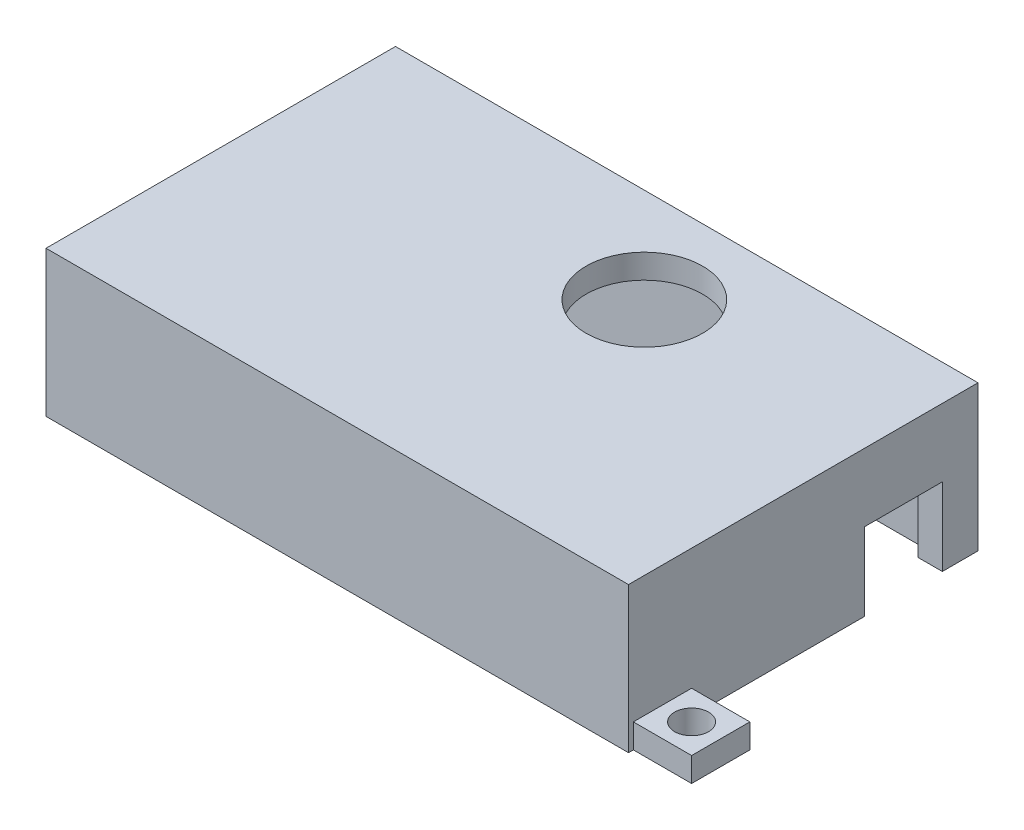
ISO-10303-21;
HEADER;
FILE_DESCRIPTION(('STEP AP214'),'2;1');
FILE_NAME('part.step','',(''),(''),'','','');
FILE_SCHEMA(('AUTOMOTIVE_DESIGN { 1 0 10303 214 1 1 1 1 }'));
ENDSEC;
DATA;
#1=APPLICATION_CONTEXT('core data for automotive mechanical design processes');
#2=APPLICATION_PROTOCOL_DEFINITION('international standard','automotive_design',2000,#1);
#3=PRODUCT_CONTEXT('',#1,'mechanical');
#4=PRODUCT('Part','Part','',(#3));
#5=PRODUCT_RELATED_PRODUCT_CATEGORY('part','',(#4));
#6=PRODUCT_DEFINITION_FORMATION('','',#4);
#7=PRODUCT_DEFINITION_CONTEXT('part definition',#1,'design');
#8=PRODUCT_DEFINITION('design','',#6,#7);
#9=PRODUCT_DEFINITION_SHAPE('','',#8);
#10=(LENGTH_UNIT() NAMED_UNIT(*) SI_UNIT(.MILLI.,.METRE.));
#11=(NAMED_UNIT(*) PLANE_ANGLE_UNIT() SI_UNIT($,.RADIAN.));
#12=(NAMED_UNIT(*) SI_UNIT($,.STERADIAN.) SOLID_ANGLE_UNIT());
#13=UNCERTAINTY_MEASURE_WITH_UNIT(LENGTH_MEASURE(1.E-05),#10,'distance_accuracy_value','');
#14=(GEOMETRIC_REPRESENTATION_CONTEXT(3) GLOBAL_UNCERTAINTY_ASSIGNED_CONTEXT((#13)) GLOBAL_UNIT_ASSIGNED_CONTEXT((#10,
#11,#12)) REPRESENTATION_CONTEXT('',''));
#15=CARTESIAN_POINT('',(0.,0.,0.));
#16=DIRECTION('',(0.,0.,1.));
#17=DIRECTION('',(1.,0.,0.));
#18=AXIS2_PLACEMENT_3D('',#15,#16,#17);
#19=CARTESIAN_POINT('',(30.,15.,-18.));
#20=DIRECTION('',(-1.,0.,0.));
#21=DIRECTION('',(0.,0.,1.));
#22=AXIS2_PLACEMENT_3D('',#19,#20,#21);
#23=PLANE('',#22);
#24=DIRECTION('',(0.,0.,1.));
#25=VECTOR('',#24,1.);
#26=CARTESIAN_POINT('',(30.,8.,-14.3270950221385));
#27=LINE('',#26,#25);
#28=CARTESIAN_POINT('',(30.,8.,-14.3270950221385));
#29=VERTEX_POINT('',#28);
#30=CARTESIAN_POINT('',(30.,8.,-6.32709502213846));
#31=VERTEX_POINT('',#30);
#32=EDGE_CURVE('E242',#29,#31,#27,.T.);
#33=ORIENTED_EDGE('',*,*,#32,.F.);
#34=DIRECTION('',(0.,1.,0.));
#35=VECTOR('',#34,1.);
#36=CARTESIAN_POINT('',(30.,0.,-14.3270950221385));
#37=LINE('',#36,#35);
#38=CARTESIAN_POINT('',(30.,0.,-14.3270950221385));
#39=VERTEX_POINT('',#38);
#40=EDGE_CURVE('E252',#39,#29,#37,.T.);
#41=ORIENTED_EDGE('',*,*,#40,.F.);
#42=DIRECTION('',(0.,0.,-1.));
#43=VECTOR('',#42,1.);
#44=CARTESIAN_POINT('',(30.,0.,-18.));
#45=LINE('',#44,#43);
#46=CARTESIAN_POINT('',(30.,0.,-18.));
#47=VERTEX_POINT('',#46);
#48=EDGE_CURVE('E497',#39,#47,#45,.T.);
#49=ORIENTED_EDGE('',*,*,#48,.T.);
#50=DIRECTION('',(0.,-1.,0.));
#51=VECTOR('',#50,1.);
#52=CARTESIAN_POINT('',(30.,15.,-18.));
#53=LINE('',#52,#51);
#54=CARTESIAN_POINT('',(30.,15.,-18.));
#55=VERTEX_POINT('',#54);
#56=EDGE_CURVE('E508',#55,#47,#53,.T.);
#57=ORIENTED_EDGE('',*,*,#56,.F.);
#58=DIRECTION('',(0.,0.,-1.));
#59=VECTOR('',#58,1.);
#60=CARTESIAN_POINT('',(30.,15.,-18.));
#61=LINE('',#60,#59);
#62=CARTESIAN_POINT('',(30.,15.,18.));
#63=VERTEX_POINT('',#62);
#64=EDGE_CURVE('E485',#63,#55,#61,.T.);
#65=ORIENTED_EDGE('',*,*,#64,.F.);
#66=DIRECTION('',(0.,-1.,0.));
#67=VECTOR('',#66,1.);
#68=CARTESIAN_POINT('',(30.,15.,18.));
#69=LINE('',#68,#67);
#70=CARTESIAN_POINT('',(30.,0.,18.));
#71=VERTEX_POINT('',#70);
#72=EDGE_CURVE('E512',#63,#71,#69,.T.);
#73=ORIENTED_EDGE('',*,*,#72,.T.);
#74=CARTESIAN_POINT('',(30.,0.,17.5));
#75=VERTEX_POINT('',#74);
#76=EDGE_CURVE('E498',#71,#75,#45,.T.);
#77=ORIENTED_EDGE('',*,*,#76,.T.);
#78=DIRECTION('',(0.,-1.,0.));
#79=VECTOR('',#78,1.);
#80=CARTESIAN_POINT('',(30.,2.5,17.5));
#81=LINE('',#80,#79);
#82=CARTESIAN_POINT('',(30.,2.5,17.5));
#83=VERTEX_POINT('',#82);
#84=EDGE_CURVE('E418',#83,#75,#81,.T.);
#85=ORIENTED_EDGE('',*,*,#84,.F.);
#86=DIRECTION('',(0.,0.,-1.));
#87=VECTOR('',#86,1.);
#88=CARTESIAN_POINT('',(30.,2.5,17.5));
#89=LINE('',#88,#87);
#90=CARTESIAN_POINT('',(30.,2.5,11.5));
#91=VERTEX_POINT('',#90);
#92=EDGE_CURVE('E393',#83,#91,#89,.T.);
#93=ORIENTED_EDGE('',*,*,#92,.T.);
#94=DIRECTION('',(0.,-1.,0.));
#95=VECTOR('',#94,1.);
#96=CARTESIAN_POINT('',(30.,2.5,11.5));
#97=LINE('',#96,#95);
#98=CARTESIAN_POINT('',(30.,0.,11.5));
#99=VERTEX_POINT('',#98);
#100=EDGE_CURVE('E408',#91,#99,#97,.T.);
#101=ORIENTED_EDGE('',*,*,#100,.T.);
#102=CARTESIAN_POINT('',(30.,0.,-6.32709502213846));
#103=VERTEX_POINT('',#102);
#104=EDGE_CURVE('E502',#99,#103,#45,.T.);
#105=ORIENTED_EDGE('',*,*,#104,.T.);
#106=DIRECTION('',(0.,-1.,0.));
#107=VECTOR('',#106,1.);
#108=CARTESIAN_POINT('',(30.,8.,-6.32709502213846));
#109=LINE('',#108,#107);
#110=EDGE_CURVE('E249',#31,#103,#109,.T.);
#111=ORIENTED_EDGE('',*,*,#110,.F.);
#112=EDGE_LOOP('',(#33,#41,#49,#57,#65,#73,#77,#85,#93,#101,#105,#111));
#113=FACE_BOUND('',#112,.T.);
#114=ADVANCED_FACE('F73',(#113),#23,.F.);
#115=CARTESIAN_POINT('',(0.,0.,0.));
#116=DIRECTION('',(0.,-1.,0.));
#117=DIRECTION('',(0.,0.,-1.));
#118=AXIS2_PLACEMENT_3D('',#115,#116,#117);
#119=PLANE('',#118);
#120=DIRECTION('',(1.,0.,0.));
#121=VECTOR('',#120,1.);
#122=CARTESIAN_POINT('',(17.5,0.,-14.3270950221385));
#123=LINE('',#122,#121);
#124=CARTESIAN_POINT('',(27.5,0.,-14.3270950221385));
#125=VERTEX_POINT('',#124);
#126=EDGE_CURVE('E255',#125,#39,#123,.T.);
#127=ORIENTED_EDGE('',*,*,#126,.F.);
#128=DIRECTION('',(0.,0.,-1.));
#129=VECTOR('',#128,1.);
#130=CARTESIAN_POINT('',(27.5,0.,15.5));
#131=LINE('',#130,#129);
#132=CARTESIAN_POINT('',(27.5,0.,-15.5));
#133=VERTEX_POINT('',#132);
#134=EDGE_CURVE('E454',#125,#133,#131,.T.);
#135=ORIENTED_EDGE('',*,*,#134,.T.);
#136=DIRECTION('',(-1.,0.,0.));
#137=VECTOR('',#136,1.);
#138=CARTESIAN_POINT('',(27.5,0.,-15.5));
#139=LINE('',#138,#137);
#140=CARTESIAN_POINT('',(-27.5,0.,-15.5));
#141=VERTEX_POINT('',#140);
#142=EDGE_CURVE('E437',#133,#141,#139,.T.);
#143=ORIENTED_EDGE('',*,*,#142,.T.);
#144=DIRECTION('',(0.,0.,1.));
#145=VECTOR('',#144,1.);
#146=CARTESIAN_POINT('',(-27.5,0.,15.5));
#147=LINE('',#146,#145);
#148=CARTESIAN_POINT('',(-27.5,0.,15.5));
#149=VERTEX_POINT('',#148);
#150=EDGE_CURVE('E421',#141,#149,#147,.T.);
#151=ORIENTED_EDGE('',*,*,#150,.T.);
#152=DIRECTION('',(1.,0.,0.));
#153=VECTOR('',#152,1.);
#154=CARTESIAN_POINT('',(27.5,0.,15.5));
#155=LINE('',#154,#153);
#156=CARTESIAN_POINT('',(27.5,0.,15.5));
#157=VERTEX_POINT('',#156);
#158=EDGE_CURVE('E450',#149,#157,#155,.T.);
#159=ORIENTED_EDGE('',*,*,#158,.T.);
#160=CARTESIAN_POINT('',(27.5,0.,-6.32709502213846));
#161=VERTEX_POINT('',#160);
#162=EDGE_CURVE('E455',#157,#161,#131,.T.);
#163=ORIENTED_EDGE('',*,*,#162,.T.);
#164=DIRECTION('',(1.,0.,0.));
#165=VECTOR('',#164,1.);
#166=CARTESIAN_POINT('',(17.5,0.,-6.32709502213846));
#167=LINE('',#166,#165);
#168=EDGE_CURVE('E269',#161,#103,#167,.T.);
#169=ORIENTED_EDGE('',*,*,#168,.T.);
#170=ORIENTED_EDGE('',*,*,#104,.F.);
#171=DIRECTION('',(1.,0.,0.));
#172=VECTOR('',#171,1.);
#173=CARTESIAN_POINT('',(30.,0.,11.5));
#174=LINE('',#173,#172);
#175=CARTESIAN_POINT('',(36.,0.,11.5));
#176=VERTEX_POINT('',#175);
#177=EDGE_CURVE('E389',#99,#176,#174,.T.);
#178=ORIENTED_EDGE('',*,*,#177,.T.);
#179=DIRECTION('',(0.,0.,-1.));
#180=VECTOR('',#179,1.);
#181=CARTESIAN_POINT('',(36.,0.,17.5));
#182=LINE('',#181,#180);
#183=CARTESIAN_POINT('',(36.,0.,17.5));
#184=VERTEX_POINT('',#183);
#185=EDGE_CURVE('E412',#184,#176,#182,.T.);
#186=ORIENTED_EDGE('',*,*,#185,.F.);
#187=DIRECTION('',(1.,0.,0.));
#188=VECTOR('',#187,1.);
#189=CARTESIAN_POINT('',(30.,0.,17.5));
#190=LINE('',#189,#188);
#191=EDGE_CURVE('E398',#75,#184,#190,.T.);
#192=ORIENTED_EDGE('',*,*,#191,.F.);
#193=ORIENTED_EDGE('',*,*,#76,.F.);
#194=DIRECTION('',(1.,0.,0.));
#195=VECTOR('',#194,1.);
#196=CARTESIAN_POINT('',(30.,0.,18.));
#197=LINE('',#196,#195);
#198=CARTESIAN_POINT('',(-30.,0.,18.));
#199=VERTEX_POINT('',#198);
#200=EDGE_CURVE('E494',#199,#71,#197,.T.);
#201=ORIENTED_EDGE('',*,*,#200,.F.);
#202=DIRECTION('',(0.,0.,1.));
#203=VECTOR('',#202,1.);
#204=CARTESIAN_POINT('',(-30.,0.,-18.));
#205=LINE('',#204,#203);
#206=CARTESIAN_POINT('',(-30.,0.,-12.));
#207=VERTEX_POINT('',#206);
#208=EDGE_CURVE('E476',#207,#199,#205,.T.);
#209=ORIENTED_EDGE('',*,*,#208,.F.);
#210=DIRECTION('',(-1.,0.,0.));
#211=VECTOR('',#210,1.);
#212=CARTESIAN_POINT('',(-30.,0.,-12.));
#213=LINE('',#212,#211);
#214=CARTESIAN_POINT('',(-36.,0.,-12.));
#215=VERTEX_POINT('',#214);
#216=EDGE_CURVE('E359',#207,#215,#213,.T.);
#217=ORIENTED_EDGE('',*,*,#216,.T.);
#218=DIRECTION('',(0.,0.,1.));
#219=VECTOR('',#218,1.);
#220=CARTESIAN_POINT('',(-36.,0.,-18.));
#221=LINE('',#220,#219);
#222=CARTESIAN_POINT('',(-36.,0.,-18.));
#223=VERTEX_POINT('',#222);
#224=EDGE_CURVE('E355',#223,#215,#221,.T.);
#225=ORIENTED_EDGE('',*,*,#224,.F.);
#226=DIRECTION('',(-1.,0.,0.));
#227=VECTOR('',#226,1.);
#228=CARTESIAN_POINT('',(30.,0.,-18.));
#229=LINE('',#228,#227);
#230=EDGE_CURVE('E482',#47,#223,#229,.T.);
#231=ORIENTED_EDGE('',*,*,#230,.F.);
#232=ORIENTED_EDGE('',*,*,#48,.F.);
#233=EDGE_LOOP('',(#127,#135,#143,#151,#159,#163,#169,#170,#178,#186,#192,#193,#201,#209,#217,
#225,#231,#232));
#234=FACE_BOUND('',#233,.T.);
#235=CARTESIAN_POINT('',(33.,0.,14.5));
#236=DIRECTION('',(0.,1.,0.));
#237=DIRECTION('',(0.,0.,1.));
#238=AXIS2_PLACEMENT_3D('',#235,#236,#237);
#239=CIRCLE('',#238,1.75);
#240=CARTESIAN_POINT('',(33.,0.,16.25));
#241=VERTEX_POINT('',#240);
#242=EDGE_CURVE('E381',#241,#241,#239,.T.);
#243=ORIENTED_EDGE('',*,*,#242,.T.);
#244=EDGE_LOOP('',(#243));
#245=FACE_BOUND('',#244,.T.);
#246=CARTESIAN_POINT('',(-33.,0.,-15.));
#247=DIRECTION('',(0.,1.,0.));
#248=DIRECTION('',(0.,0.,1.));
#249=AXIS2_PLACEMENT_3D('',#246,#247,#248);
#250=CIRCLE('',#249,1.75);
#251=CARTESIAN_POINT('',(-33.,0.,-13.25));
#252=VERTEX_POINT('',#251);
#253=EDGE_CURVE('E377',#252,#252,#250,.T.);
#254=ORIENTED_EDGE('',*,*,#253,.T.);
#255=EDGE_LOOP('',(#254));
#256=FACE_BOUND('',#255,.T.);
#257=ADVANCED_FACE('F533',(#234,#245,#256),#119,.T.);
#258=CARTESIAN_POINT('',(-30.,15.,-18.));
#259=DIRECTION('',(1.,0.,0.));
#260=DIRECTION('',(0.,0.,-1.));
#261=AXIS2_PLACEMENT_3D('',#258,#259,#260);
#262=PLANE('',#261);
#263=DIRECTION('',(0.,-1.,0.));
#264=VECTOR('',#263,1.);
#265=CARTESIAN_POINT('',(-30.,15.,-18.));
#266=LINE('',#265,#264);
#267=CARTESIAN_POINT('',(-30.,15.,-18.));
#268=VERTEX_POINT('',#267);
#269=CARTESIAN_POINT('',(-30.,2.5,-18.));
#270=VERTEX_POINT('',#269);
#271=EDGE_CURVE('E491',#268,#270,#266,.T.);
#272=ORIENTED_EDGE('',*,*,#271,.T.);
#273=DIRECTION('',(0.,0.,1.));
#274=VECTOR('',#273,1.);
#275=CARTESIAN_POINT('',(-30.,2.5,-18.));
#276=LINE('',#275,#274);
#277=CARTESIAN_POINT('',(-30.,2.5,-12.));
#278=VERTEX_POINT('',#277);
#279=EDGE_CURVE('E360',#270,#278,#276,.T.);
#280=ORIENTED_EDGE('',*,*,#279,.T.);
#281=DIRECTION('',(0.,-1.,0.));
#282=VECTOR('',#281,1.);
#283=CARTESIAN_POINT('',(-30.,2.5,-12.));
#284=LINE('',#283,#282);
#285=EDGE_CURVE('E343',#278,#207,#284,.T.);
#286=ORIENTED_EDGE('',*,*,#285,.T.);
#287=ORIENTED_EDGE('',*,*,#208,.T.);
#288=DIRECTION('',(0.,-1.,0.));
#289=VECTOR('',#288,1.);
#290=CARTESIAN_POINT('',(-30.,15.,18.));
#291=LINE('',#290,#289);
#292=CARTESIAN_POINT('',(-30.,15.,18.));
#293=VERTEX_POINT('',#292);
#294=EDGE_CURVE('E516',#293,#199,#291,.T.);
#295=ORIENTED_EDGE('',*,*,#294,.F.);
#296=DIRECTION('',(0.,0.,1.));
#297=VECTOR('',#296,1.);
#298=CARTESIAN_POINT('',(-30.,15.,-18.));
#299=LINE('',#298,#297);
#300=EDGE_CURVE('E477',#268,#293,#299,.T.);
#301=ORIENTED_EDGE('',*,*,#300,.F.);
#302=EDGE_LOOP('',(#272,#280,#286,#287,#295,#301));
#303=FACE_BOUND('',#302,.T.);
#304=ADVANCED_FACE('F75',(#303),#262,.F.);
#305=CARTESIAN_POINT('',(30.,15.,18.));
#306=DIRECTION('',(0.,0.,-1.));
#307=DIRECTION('',(-1.,0.,0.));
#308=AXIS2_PLACEMENT_3D('',#305,#306,#307);
#309=PLANE('',#308);
#310=ORIENTED_EDGE('',*,*,#200,.T.);
#311=ORIENTED_EDGE('',*,*,#72,.F.);
#312=DIRECTION('',(1.,0.,0.));
#313=VECTOR('',#312,1.);
#314=CARTESIAN_POINT('',(30.,15.,18.));
#315=LINE('',#314,#313);
#316=EDGE_CURVE('E481',#293,#63,#315,.T.);
#317=ORIENTED_EDGE('',*,*,#316,.F.);
#318=ORIENTED_EDGE('',*,*,#294,.T.);
#319=EDGE_LOOP('',(#310,#311,#317,#318));
#320=FACE_BOUND('',#319,.T.);
#321=ADVANCED_FACE('F575',(#320),#309,.F.);
#322=CARTESIAN_POINT('',(30.,15.,-18.));
#323=DIRECTION('',(0.,0.,1.));
#324=DIRECTION('',(1.,0.,0.));
#325=AXIS2_PLACEMENT_3D('',#322,#323,#324);
#326=PLANE('',#325);
#327=ORIENTED_EDGE('',*,*,#230,.T.);
#328=DIRECTION('',(0.,-1.,0.));
#329=VECTOR('',#328,1.);
#330=CARTESIAN_POINT('',(-36.,2.5,-18.));
#331=LINE('',#330,#329);
#332=CARTESIAN_POINT('',(-36.,2.5,-18.));
#333=VERTEX_POINT('',#332);
#334=EDGE_CURVE('E351',#333,#223,#331,.T.);
#335=ORIENTED_EDGE('',*,*,#334,.F.);
#336=DIRECTION('',(-1.,0.,0.));
#337=VECTOR('',#336,1.);
#338=CARTESIAN_POINT('',(-30.,2.5,-18.));
#339=LINE('',#338,#337);
#340=EDGE_CURVE('E347',#270,#333,#339,.T.);
#341=ORIENTED_EDGE('',*,*,#340,.F.);
#342=ORIENTED_EDGE('',*,*,#271,.F.);
#343=DIRECTION('',(-1.,0.,0.));
#344=VECTOR('',#343,1.);
#345=CARTESIAN_POINT('',(30.,15.,-18.));
#346=LINE('',#345,#344);
#347=EDGE_CURVE('E488',#55,#268,#346,.T.);
#348=ORIENTED_EDGE('',*,*,#347,.F.);
#349=ORIENTED_EDGE('',*,*,#56,.T.);
#350=EDGE_LOOP('',(#327,#335,#341,#342,#348,#349));
#351=FACE_BOUND('',#350,.T.);
#352=ADVANCED_FACE('F574',(#351),#326,.F.);
#353=CARTESIAN_POINT('',(0.,15.,0.));
#354=DIRECTION('',(0.,-1.,0.));
#355=DIRECTION('',(0.,0.,-1.));
#356=AXIS2_PLACEMENT_3D('',#353,#354,#355);
#357=PLANE('',#356);
#358=CARTESIAN_POINT('',(5.40473511232875,15.,-8.22671209910908));
#359=DIRECTION('',(0.,1.,0.));
#360=DIRECTION('',(0.,0.,1.));
#361=AXIS2_PLACEMENT_3D('',#358,#359,#360);
#362=CIRCLE('',#361,6.);
#363=CARTESIAN_POINT('',(5.40473511232875,15.,-2.22671209910908));
#364=VERTEX_POINT('',#363);
#365=EDGE_CURVE('E338',#364,#364,#362,.T.);
#366=ORIENTED_EDGE('',*,*,#365,.F.);
#367=EDGE_LOOP('',(#366));
#368=FACE_BOUND('',#367,.T.);
#369=ORIENTED_EDGE('',*,*,#300,.T.);
#370=ORIENTED_EDGE('',*,*,#316,.T.);
#371=ORIENTED_EDGE('',*,*,#64,.T.);
#372=ORIENTED_EDGE('',*,*,#347,.T.);
#373=EDGE_LOOP('',(#369,#370,#371,#372));
#374=FACE_BOUND('',#373,.T.);
#375=ADVANCED_FACE('F565',(#368,#374),#357,.F.);
#376=CARTESIAN_POINT('',(-27.5,12.5,15.5));
#377=DIRECTION('',(1.,0.,0.));
#378=DIRECTION('',(0.,0.,-1.));
#379=AXIS2_PLACEMENT_3D('',#376,#377,#378);
#380=PLANE('',#379);
#381=ORIENTED_EDGE('',*,*,#150,.F.);
#382=DIRECTION('',(0.,-1.,0.));
#383=VECTOR('',#382,1.);
#384=CARTESIAN_POINT('',(-27.5,12.5,-15.5));
#385=LINE('',#384,#383);
#386=CARTESIAN_POINT('',(-27.5,12.5,-15.5));
#387=VERTEX_POINT('',#386);
#388=EDGE_CURVE('E446',#387,#141,#385,.T.);
#389=ORIENTED_EDGE('',*,*,#388,.F.);
#390=DIRECTION('',(0.,0.,1.));
#391=VECTOR('',#390,1.);
#392=CARTESIAN_POINT('',(-27.5,12.5,15.5));
#393=LINE('',#392,#391);
#394=CARTESIAN_POINT('',(-27.5,12.5,15.5));
#395=VERTEX_POINT('',#394);
#396=EDGE_CURVE('E432',#387,#395,#393,.T.);
#397=ORIENTED_EDGE('',*,*,#396,.T.);
#398=DIRECTION('',(0.,-1.,0.));
#399=VECTOR('',#398,1.);
#400=CARTESIAN_POINT('',(-27.5,12.5,15.5));
#401=LINE('',#400,#399);
#402=EDGE_CURVE('E472',#395,#149,#401,.T.);
#403=ORIENTED_EDGE('',*,*,#402,.T.);
#404=EDGE_LOOP('',(#381,#389,#397,#403));
#405=FACE_BOUND('',#404,.T.);
#406=ADVANCED_FACE('F555',(#405),#380,.T.);
#407=CARTESIAN_POINT('',(27.5,12.5,15.5));
#408=DIRECTION('',(0.,0.,-1.));
#409=DIRECTION('',(-1.,0.,0.));
#410=AXIS2_PLACEMENT_3D('',#407,#408,#409);
#411=PLANE('',#410);
#412=ORIENTED_EDGE('',*,*,#158,.F.);
#413=ORIENTED_EDGE('',*,*,#402,.F.);
#414=DIRECTION('',(1.,0.,0.));
#415=VECTOR('',#414,1.);
#416=CARTESIAN_POINT('',(27.5,12.5,15.5));
#417=LINE('',#416,#415);
#418=CARTESIAN_POINT('',(27.5,12.5,15.5));
#419=VERTEX_POINT('',#418);
#420=EDGE_CURVE('E436',#395,#419,#417,.T.);
#421=ORIENTED_EDGE('',*,*,#420,.T.);
#422=DIRECTION('',(0.,-1.,0.));
#423=VECTOR('',#422,1.);
#424=CARTESIAN_POINT('',(27.5,12.5,15.5));
#425=LINE('',#424,#423);
#426=EDGE_CURVE('E469',#419,#157,#425,.T.);
#427=ORIENTED_EDGE('',*,*,#426,.T.);
#428=EDGE_LOOP('',(#412,#413,#421,#427));
#429=FACE_BOUND('',#428,.T.);
#430=ADVANCED_FACE('F557',(#429),#411,.T.);
#431=CARTESIAN_POINT('',(27.5,12.5,15.5));
#432=DIRECTION('',(-1.,0.,0.));
#433=DIRECTION('',(0.,0.,1.));
#434=AXIS2_PLACEMENT_3D('',#431,#432,#433);
#435=PLANE('',#434);
#436=DIRECTION('',(0.,-1.,0.));
#437=VECTOR('',#436,1.);
#438=CARTESIAN_POINT('',(27.5,12.5,-14.3270950221385));
#439=LINE('',#438,#437);
#440=CARTESIAN_POINT('',(27.5,8.,-14.3270950221385));
#441=VERTEX_POINT('',#440);
#442=EDGE_CURVE('E12',#441,#125,#439,.T.);
#443=ORIENTED_EDGE('',*,*,#442,.F.);
#444=DIRECTION('',(0.,0.,-1.));
#445=VECTOR('',#444,1.);
#446=CARTESIAN_POINT('',(27.5,7.99999999999999,15.5));
#447=LINE('',#446,#445);
#448=CARTESIAN_POINT('',(27.5,8.,-6.32709502213847));
#449=VERTEX_POINT('',#448);
#450=EDGE_CURVE('E245',#449,#441,#447,.T.);
#451=ORIENTED_EDGE('',*,*,#450,.F.);
#452=DIRECTION('',(0.,1.,0.));
#453=VECTOR('',#452,1.);
#454=CARTESIAN_POINT('',(27.5,12.5,-6.32709502213846));
#455=LINE('',#454,#453);
#456=EDGE_CURVE('E82',#161,#449,#455,.T.);
#457=ORIENTED_EDGE('',*,*,#456,.F.);
#458=ORIENTED_EDGE('',*,*,#162,.F.);
#459=ORIENTED_EDGE('',*,*,#426,.F.);
#460=DIRECTION('',(0.,0.,-1.));
#461=VECTOR('',#460,1.);
#462=CARTESIAN_POINT('',(27.5,12.5,15.5));
#463=LINE('',#462,#461);
#464=CARTESIAN_POINT('',(27.5,12.5,-15.5));
#465=VERTEX_POINT('',#464);
#466=EDGE_CURVE('E440',#419,#465,#463,.T.);
#467=ORIENTED_EDGE('',*,*,#466,.T.);
#468=DIRECTION('',(0.,-1.,0.));
#469=VECTOR('',#468,1.);
#470=CARTESIAN_POINT('',(27.5,12.5,-15.5));
#471=LINE('',#470,#469);
#472=EDGE_CURVE('E465',#465,#133,#471,.T.);
#473=ORIENTED_EDGE('',*,*,#472,.T.);
#474=ORIENTED_EDGE('',*,*,#134,.F.);
#475=EDGE_LOOP('',(#443,#451,#457,#458,#459,#467,#473,#474));
#476=FACE_BOUND('',#475,.T.);
#477=ADVANCED_FACE('F530',(#476),#435,.T.);
#478=CARTESIAN_POINT('',(27.5,12.5,-15.5));
#479=DIRECTION('',(0.,0.,1.));
#480=DIRECTION('',(1.,0.,0.));
#481=AXIS2_PLACEMENT_3D('',#478,#479,#480);
#482=PLANE('',#481);
#483=ORIENTED_EDGE('',*,*,#142,.F.);
#484=ORIENTED_EDGE('',*,*,#472,.F.);
#485=DIRECTION('',(-1.,0.,0.));
#486=VECTOR('',#485,1.);
#487=CARTESIAN_POINT('',(27.5,12.5,-15.5));
#488=LINE('',#487,#486);
#489=EDGE_CURVE('E443',#465,#387,#488,.T.);
#490=ORIENTED_EDGE('',*,*,#489,.T.);
#491=ORIENTED_EDGE('',*,*,#388,.T.);
#492=EDGE_LOOP('',(#483,#484,#490,#491));
#493=FACE_BOUND('',#492,.T.);
#494=ADVANCED_FACE('F553',(#493),#482,.T.);
#495=CARTESIAN_POINT('',(0.,12.5,0.));
#496=DIRECTION('',(0.,1.,0.));
#497=DIRECTION('',(0.,0.,1.));
#498=AXIS2_PLACEMENT_3D('',#495,#496,#497);
#499=PLANE('',#498);
#500=DIRECTION('',(-1.,0.,0.));
#501=VECTOR('',#500,1.);
#502=CARTESIAN_POINT('',(0.,12.5,-2.49999999999999));
#503=LINE('',#502,#501);
#504=CARTESIAN_POINT('',(-14.4479855488839,12.5,-2.49999999999999));
#505=VERTEX_POINT('',#504);
#506=CARTESIAN_POINT('',(-17.5,12.5,-2.49999999999999));
#507=VERTEX_POINT('',#506);
#508=EDGE_CURVE('E294',#505,#507,#503,.T.);
#509=ORIENTED_EDGE('',*,*,#508,.F.);
#510=DIRECTION('',(0.,0.,1.));
#511=VECTOR('',#510,1.);
#512=CARTESIAN_POINT('',(-14.4479855488839,12.5,0.));
#513=LINE('',#512,#511);
#514=CARTESIAN_POINT('',(-14.4479855488839,12.5,-6.53553390593274));
#515=VERTEX_POINT('',#514);
#516=EDGE_CURVE('E97',#515,#505,#513,.T.);
#517=ORIENTED_EDGE('',*,*,#516,.F.);
#518=DIRECTION('',(1.,0.,0.));
#519=VECTOR('',#518,1.);
#520=CARTESIAN_POINT('',(0.,12.5,-6.53553390593274));
#521=LINE('',#520,#519);
#522=CARTESIAN_POINT('',(-21.0355339059327,12.5,-6.53553390593274));
#523=VERTEX_POINT('',#522);
#524=EDGE_CURVE('E277',#523,#515,#521,.T.);
#525=ORIENTED_EDGE('',*,*,#524,.F.);
#526=DIRECTION('',(0.,0.,1.));
#527=VECTOR('',#526,1.);
#528=CARTESIAN_POINT('',(-21.0355339059327,12.5,0.));
#529=LINE('',#528,#527);
#530=CARTESIAN_POINT('',(-21.0355339059327,12.5,0.));
#531=VERTEX_POINT('',#530);
#532=EDGE_CURVE('E282',#523,#531,#529,.T.);
#533=ORIENTED_EDGE('',*,*,#532,.T.);
#534=DIRECTION('',(1.,0.,0.));
#535=VECTOR('',#534,1.);
#536=CARTESIAN_POINT('',(0.,12.5,0.));
#537=LINE('',#536,#535);
#538=CARTESIAN_POINT('',(-17.5,12.5,0.));
#539=VERTEX_POINT('',#538);
#540=EDGE_CURVE('E286',#531,#539,#537,.T.);
#541=ORIENTED_EDGE('',*,*,#540,.T.);
#542=DIRECTION('',(0.,0.,-1.));
#543=VECTOR('',#542,1.);
#544=CARTESIAN_POINT('',(-17.5,12.5,0.));
#545=LINE('',#544,#543);
#546=EDGE_CURVE('E290',#539,#507,#545,.T.);
#547=ORIENTED_EDGE('',*,*,#546,.T.);
#548=EDGE_LOOP('',(#509,#517,#525,#533,#541,#547));
#549=FACE_BOUND('',#548,.T.);
#550=CARTESIAN_POINT('',(5.40473511232875,12.5,-8.22671209910908));
#551=DIRECTION('',(0.,1.,0.));
#552=DIRECTION('',(0.,0.,1.));
#553=AXIS2_PLACEMENT_3D('',#550,#551,#552);
#554=CIRCLE('',#553,6.);
#555=CARTESIAN_POINT('',(5.40473511232875,12.5,-2.22671209910908));
#556=VERTEX_POINT('',#555);
#557=EDGE_CURVE('E342',#556,#556,#554,.F.);
#558=ORIENTED_EDGE('',*,*,#557,.F.);
#559=EDGE_LOOP('',(#558));
#560=FACE_BOUND('',#559,.T.);
#561=ORIENTED_EDGE('',*,*,#396,.F.);
#562=ORIENTED_EDGE('',*,*,#489,.F.);
#563=ORIENTED_EDGE('',*,*,#466,.F.);
#564=ORIENTED_EDGE('',*,*,#420,.F.);
#565=EDGE_LOOP('',(#561,#562,#563,#564));
#566=FACE_BOUND('',#565,.T.);
#567=ADVANCED_FACE('F549',(#549,#560,#566),#499,.F.);
#568=CARTESIAN_POINT('',(0.,2.5,0.));
#569=DIRECTION('',(0.,-1.,0.));
#570=DIRECTION('',(0.,0.,-1.));
#571=AXIS2_PLACEMENT_3D('',#568,#569,#570);
#572=PLANE('',#571);
#573=ORIENTED_EDGE('',*,*,#92,.F.);
#574=DIRECTION('',(1.,0.,0.));
#575=VECTOR('',#574,1.);
#576=CARTESIAN_POINT('',(30.,2.5,17.5));
#577=LINE('',#576,#575);
#578=CARTESIAN_POINT('',(36.,2.5,17.5));
#579=VERTEX_POINT('',#578);
#580=EDGE_CURVE('E405',#83,#579,#577,.T.);
#581=ORIENTED_EDGE('',*,*,#580,.T.);
#582=DIRECTION('',(0.,0.,-1.));
#583=VECTOR('',#582,1.);
#584=CARTESIAN_POINT('',(36.,2.5,17.5));
#585=LINE('',#584,#583);
#586=CARTESIAN_POINT('',(36.,2.5,11.5));
#587=VERTEX_POINT('',#586);
#588=EDGE_CURVE('E402',#579,#587,#585,.T.);
#589=ORIENTED_EDGE('',*,*,#588,.T.);
#590=DIRECTION('',(1.,0.,0.));
#591=VECTOR('',#590,1.);
#592=CARTESIAN_POINT('',(30.,2.5,11.5));
#593=LINE('',#592,#591);
#594=EDGE_CURVE('E397',#91,#587,#593,.T.);
#595=ORIENTED_EDGE('',*,*,#594,.F.);
#596=EDGE_LOOP('',(#573,#581,#589,#595));
#597=FACE_BOUND('',#596,.T.);
#598=CARTESIAN_POINT('',(33.,2.5,14.5));
#599=DIRECTION('',(0.,1.,0.));
#600=DIRECTION('',(0.,0.,1.));
#601=AXIS2_PLACEMENT_3D('',#598,#599,#600);
#602=CIRCLE('',#601,1.75);
#603=CARTESIAN_POINT('',(33.,2.5,16.25));
#604=VERTEX_POINT('',#603);
#605=EDGE_CURVE('E385',#604,#604,#602,.T.);
#606=ORIENTED_EDGE('',*,*,#605,.F.);
#607=EDGE_LOOP('',(#606));
#608=FACE_BOUND('',#607,.T.);
#609=ADVANCED_FACE('F602',(#597,#608),#572,.F.);
#610=CARTESIAN_POINT('',(30.,2.5,17.5));
#611=DIRECTION('',(0.,0.,-1.));
#612=DIRECTION('',(-1.,0.,0.));
#613=AXIS2_PLACEMENT_3D('',#610,#611,#612);
#614=PLANE('',#613);
#615=ORIENTED_EDGE('',*,*,#191,.T.);
#616=DIRECTION('',(0.,-1.,0.));
#617=VECTOR('',#616,1.);
#618=CARTESIAN_POINT('',(36.,2.5,17.5));
#619=LINE('',#618,#617);
#620=EDGE_CURVE('E422',#579,#184,#619,.T.);
#621=ORIENTED_EDGE('',*,*,#620,.F.);
#622=ORIENTED_EDGE('',*,*,#580,.F.);
#623=ORIENTED_EDGE('',*,*,#84,.T.);
#624=EDGE_LOOP('',(#615,#621,#622,#623));
#625=FACE_BOUND('',#624,.T.);
#626=ADVANCED_FACE('F594',(#625),#614,.F.);
#627=CARTESIAN_POINT('',(36.,2.5,17.5));
#628=DIRECTION('',(-1.,0.,0.));
#629=DIRECTION('',(0.,0.,1.));
#630=AXIS2_PLACEMENT_3D('',#627,#628,#629);
#631=PLANE('',#630);
#632=ORIENTED_EDGE('',*,*,#185,.T.);
#633=DIRECTION('',(0.,-1.,0.));
#634=VECTOR('',#633,1.);
#635=CARTESIAN_POINT('',(36.,2.5,11.5));
#636=LINE('',#635,#634);
#637=EDGE_CURVE('E426',#587,#176,#636,.T.);
#638=ORIENTED_EDGE('',*,*,#637,.F.);
#639=ORIENTED_EDGE('',*,*,#588,.F.);
#640=ORIENTED_EDGE('',*,*,#620,.T.);
#641=EDGE_LOOP('',(#632,#638,#639,#640));
#642=FACE_BOUND('',#641,.T.);
#643=ADVANCED_FACE('F597',(#642),#631,.F.);
#644=CARTESIAN_POINT('',(30.,2.5,11.5));
#645=DIRECTION('',(0.,0.,-1.));
#646=DIRECTION('',(-1.,0.,0.));
#647=AXIS2_PLACEMENT_3D('',#644,#645,#646);
#648=PLANE('',#647);
#649=ORIENTED_EDGE('',*,*,#177,.F.);
#650=ORIENTED_EDGE('',*,*,#100,.F.);
#651=ORIENTED_EDGE('',*,*,#594,.T.);
#652=ORIENTED_EDGE('',*,*,#637,.T.);
#653=EDGE_LOOP('',(#649,#650,#651,#652));
#654=FACE_BOUND('',#653,.T.);
#655=ADVANCED_FACE('F605',(#654),#648,.T.);
#656=CARTESIAN_POINT('',(33.,2.5,14.5));
#657=DIRECTION('',(0.,-1.,0.));
#658=DIRECTION('',(0.,0.,-1.));
#659=AXIS2_PLACEMENT_3D('',#656,#657,#658);
#660=CYLINDRICAL_SURFACE('',#659,1.75);
#661=ORIENTED_EDGE('',*,*,#605,.T.);
#662=EDGE_LOOP('',(#661));
#663=FACE_BOUND('',#662,.T.);
#664=ORIENTED_EDGE('',*,*,#242,.F.);
#665=EDGE_LOOP('',(#664));
#666=FACE_BOUND('',#665,.T.);
#667=ADVANCED_FACE('F607',(#663,#666),#660,.F.);
#668=CARTESIAN_POINT('',(0.,2.5,0.));
#669=DIRECTION('',(0.,-1.,0.));
#670=DIRECTION('',(0.,0.,-1.));
#671=AXIS2_PLACEMENT_3D('',#668,#669,#670);
#672=PLANE('',#671);
#673=ORIENTED_EDGE('',*,*,#279,.F.);
#674=ORIENTED_EDGE('',*,*,#340,.T.);
#675=DIRECTION('',(0.,0.,1.));
#676=VECTOR('',#675,1.);
#677=CARTESIAN_POINT('',(-36.,2.5,-18.));
#678=LINE('',#677,#676);
#679=CARTESIAN_POINT('',(-36.,2.5,-12.));
#680=VERTEX_POINT('',#679);
#681=EDGE_CURVE('E367',#333,#680,#678,.T.);
#682=ORIENTED_EDGE('',*,*,#681,.T.);
#683=DIRECTION('',(-1.,0.,0.));
#684=VECTOR('',#683,1.);
#685=CARTESIAN_POINT('',(-30.,2.5,-12.));
#686=LINE('',#685,#684);
#687=EDGE_CURVE('E370',#278,#680,#686,.T.);
#688=ORIENTED_EDGE('',*,*,#687,.F.);
#689=EDGE_LOOP('',(#673,#674,#682,#688));
#690=FACE_BOUND('',#689,.T.);
#691=CARTESIAN_POINT('',(-33.,2.5,-15.));
#692=DIRECTION('',(0.,1.,0.));
#693=DIRECTION('',(0.,0.,1.));
#694=AXIS2_PLACEMENT_3D('',#691,#692,#693);
#695=CIRCLE('',#694,1.75);
#696=CARTESIAN_POINT('',(-33.,2.5,-13.25));
#697=VERTEX_POINT('',#696);
#698=EDGE_CURVE('E364',#697,#697,#695,.T.);
#699=ORIENTED_EDGE('',*,*,#698,.F.);
#700=EDGE_LOOP('',(#699));
#701=FACE_BOUND('',#700,.T.);
#702=ADVANCED_FACE('F613',(#690,#701),#672,.F.);
#703=CARTESIAN_POINT('',(-36.,2.5,-18.));
#704=DIRECTION('',(1.,0.,0.));
#705=DIRECTION('',(0.,0.,-1.));
#706=AXIS2_PLACEMENT_3D('',#703,#704,#705);
#707=PLANE('',#706);
#708=ORIENTED_EDGE('',*,*,#224,.T.);
#709=DIRECTION('',(0.,-1.,0.));
#710=VECTOR('',#709,1.);
#711=CARTESIAN_POINT('',(-36.,2.5,-12.));
#712=LINE('',#711,#710);
#713=EDGE_CURVE('E348',#680,#215,#712,.T.);
#714=ORIENTED_EDGE('',*,*,#713,.F.);
#715=ORIENTED_EDGE('',*,*,#681,.F.);
#716=ORIENTED_EDGE('',*,*,#334,.T.);
#717=EDGE_LOOP('',(#708,#714,#715,#716));
#718=FACE_BOUND('',#717,.T.);
#719=ADVANCED_FACE('F670',(#718),#707,.F.);
#720=CARTESIAN_POINT('',(-30.,2.5,-12.));
#721=DIRECTION('',(0.,0.,1.));
#722=DIRECTION('',(1.,0.,0.));
#723=AXIS2_PLACEMENT_3D('',#720,#721,#722);
#724=PLANE('',#723);
#725=ORIENTED_EDGE('',*,*,#216,.F.);
#726=ORIENTED_EDGE('',*,*,#285,.F.);
#727=ORIENTED_EDGE('',*,*,#687,.T.);
#728=ORIENTED_EDGE('',*,*,#713,.T.);
#729=EDGE_LOOP('',(#725,#726,#727,#728));
#730=FACE_BOUND('',#729,.T.);
#731=ADVANCED_FACE('F680',(#730),#724,.T.);
#732=CARTESIAN_POINT('',(-33.,2.5,-15.));
#733=DIRECTION('',(0.,-1.,0.));
#734=DIRECTION('',(0.,0.,-1.));
#735=AXIS2_PLACEMENT_3D('',#732,#733,#734);
#736=CYLINDRICAL_SURFACE('',#735,1.75);
#737=ORIENTED_EDGE('',*,*,#698,.T.);
#738=EDGE_LOOP('',(#737));
#739=FACE_BOUND('',#738,.T.);
#740=ORIENTED_EDGE('',*,*,#253,.F.);
#741=EDGE_LOOP('',(#740));
#742=FACE_BOUND('',#741,.T.);
#743=ADVANCED_FACE('F690',(#739,#742),#736,.F.);
#744=CARTESIAN_POINT('',(5.40473511232875,15.,-8.22671209910908));
#745=DIRECTION('',(0.,-1.,0.));
#746=DIRECTION('',(0.,0.,-1.));
#747=AXIS2_PLACEMENT_3D('',#744,#745,#746);
#748=CYLINDRICAL_SURFACE('',#747,6.);
#749=ORIENTED_EDGE('',*,*,#365,.T.);
#750=EDGE_LOOP('',(#749));
#751=FACE_BOUND('',#750,.T.);
#752=ORIENTED_EDGE('',*,*,#557,.T.);
#753=EDGE_LOOP('',(#752));
#754=FACE_BOUND('',#753,.T.);
#755=ADVANCED_FACE('F700',(#751,#754),#748,.F.);
#756=CARTESIAN_POINT('',(-14.4479855488839,12.5,0.));
#757=DIRECTION('',(1.,0.,0.));
#758=DIRECTION('',(0.,0.,-1.));
#759=AXIS2_PLACEMENT_3D('',#756,#757,#758);
#760=PLANE('',#759);
#761=DIRECTION('',(0.,0.,1.));
#762=VECTOR('',#761,1.);
#763=CARTESIAN_POINT('',(-14.4479855488839,0.,0.));
#764=LINE('',#763,#762);
#765=CARTESIAN_POINT('',(-14.4479855488839,0.,-6.53553390593274));
#766=VERTEX_POINT('',#765);
#767=CARTESIAN_POINT('',(-14.4479855488839,0.,-2.49999999999999));
#768=VERTEX_POINT('',#767);
#769=EDGE_CURVE('E268',#766,#768,#764,.T.);
#770=ORIENTED_EDGE('',*,*,#769,.F.);
#771=DIRECTION('',(0.,-1.,0.));
#772=VECTOR('',#771,1.);
#773=CARTESIAN_POINT('',(-14.4479855488839,12.5,-6.53553390593274));
#774=LINE('',#773,#772);
#775=EDGE_CURVE('E335',#515,#766,#774,.T.);
#776=ORIENTED_EDGE('',*,*,#775,.F.);
#777=ORIENTED_EDGE('',*,*,#516,.T.);
#778=DIRECTION('',(0.,-1.,0.));
#779=VECTOR('',#778,1.);
#780=CARTESIAN_POINT('',(-14.4479855488839,12.5,-2.49999999999999));
#781=LINE('',#780,#779);
#782=EDGE_CURVE('E298',#505,#768,#781,.T.);
#783=ORIENTED_EDGE('',*,*,#782,.T.);
#784=EDGE_LOOP('',(#770,#776,#777,#783));
#785=FACE_BOUND('',#784,.T.);
#786=ADVANCED_FACE('F719',(#785),#760,.T.);
#787=CARTESIAN_POINT('',(0.,12.5,-6.53553390593274));
#788=DIRECTION('',(0.,0.,-1.));
#789=DIRECTION('',(-1.,0.,0.));
#790=AXIS2_PLACEMENT_3D('',#787,#788,#789);
#791=PLANE('',#790);
#792=DIRECTION('',(1.,0.,0.));
#793=VECTOR('',#792,1.);
#794=CARTESIAN_POINT('',(0.,0.,-6.53553390593274));
#795=LINE('',#794,#793);
#796=CARTESIAN_POINT('',(-21.0355339059327,0.,-6.53553390593274));
#797=VERTEX_POINT('',#796);
#798=EDGE_CURVE('E302',#797,#766,#795,.T.);
#799=ORIENTED_EDGE('',*,*,#798,.F.);
#800=DIRECTION('',(0.,-1.,0.));
#801=VECTOR('',#800,1.);
#802=CARTESIAN_POINT('',(-21.0355339059327,12.5,-6.53553390593274));
#803=LINE('',#802,#801);
#804=EDGE_CURVE('E332',#523,#797,#803,.T.);
#805=ORIENTED_EDGE('',*,*,#804,.F.);
#806=ORIENTED_EDGE('',*,*,#524,.T.);
#807=ORIENTED_EDGE('',*,*,#775,.T.);
#808=EDGE_LOOP('',(#799,#805,#806,#807));
#809=FACE_BOUND('',#808,.T.);
#810=ADVANCED_FACE('F729',(#809),#791,.T.);
#811=CARTESIAN_POINT('',(-21.0355339059327,12.5,0.));
#812=DIRECTION('',(1.,0.,0.));
#813=DIRECTION('',(0.,0.,-1.));
#814=AXIS2_PLACEMENT_3D('',#811,#812,#813);
#815=PLANE('',#814);
#816=DIRECTION('',(0.,0.,1.));
#817=VECTOR('',#816,1.);
#818=CARTESIAN_POINT('',(-21.0355339059327,0.,0.));
#819=LINE('',#818,#817);
#820=CARTESIAN_POINT('',(-21.0355339059327,0.,0.));
#821=VERTEX_POINT('',#820);
#822=EDGE_CURVE('E306',#797,#821,#819,.T.);
#823=ORIENTED_EDGE('',*,*,#822,.T.);
#824=DIRECTION('',(0.,-1.,0.));
#825=VECTOR('',#824,1.);
#826=CARTESIAN_POINT('',(-21.0355339059327,12.5,0.));
#827=LINE('',#826,#825);
#828=EDGE_CURVE('E328',#531,#821,#827,.T.);
#829=ORIENTED_EDGE('',*,*,#828,.F.);
#830=ORIENTED_EDGE('',*,*,#532,.F.);
#831=ORIENTED_EDGE('',*,*,#804,.T.);
#832=EDGE_LOOP('',(#823,#829,#830,#831));
#833=FACE_BOUND('',#832,.T.);
#834=ADVANCED_FACE('F735',(#833),#815,.F.);
#835=CARTESIAN_POINT('',(0.,12.5,0.));
#836=DIRECTION('',(0.,0.,-1.));
#837=DIRECTION('',(-1.,0.,0.));
#838=AXIS2_PLACEMENT_3D('',#835,#836,#837);
#839=PLANE('',#838);
#840=DIRECTION('',(1.,0.,0.));
#841=VECTOR('',#840,1.);
#842=CARTESIAN_POINT('',(0.,0.,0.));
#843=LINE('',#842,#841);
#844=CARTESIAN_POINT('',(-17.5,0.,0.));
#845=VERTEX_POINT('',#844);
#846=EDGE_CURVE('E309',#821,#845,#843,.T.);
#847=ORIENTED_EDGE('',*,*,#846,.T.);
#848=DIRECTION('',(0.,-1.,0.));
#849=VECTOR('',#848,1.);
#850=CARTESIAN_POINT('',(-17.5,12.5,0.));
#851=LINE('',#850,#849);
#852=EDGE_CURVE('E324',#539,#845,#851,.T.);
#853=ORIENTED_EDGE('',*,*,#852,.F.);
#854=ORIENTED_EDGE('',*,*,#540,.F.);
#855=ORIENTED_EDGE('',*,*,#828,.T.);
#856=EDGE_LOOP('',(#847,#853,#854,#855));
#857=FACE_BOUND('',#856,.T.);
#858=ADVANCED_FACE('F743',(#857),#839,.F.);
#859=CARTESIAN_POINT('',(-17.5,12.5,0.));
#860=DIRECTION('',(-1.,0.,0.));
#861=DIRECTION('',(0.,0.,1.));
#862=AXIS2_PLACEMENT_3D('',#859,#860,#861);
#863=PLANE('',#862);
#864=DIRECTION('',(0.,0.,-1.));
#865=VECTOR('',#864,1.);
#866=CARTESIAN_POINT('',(-17.5,0.,0.));
#867=LINE('',#866,#865);
#868=CARTESIAN_POINT('',(-17.5,0.,-2.49999999999999));
#869=VERTEX_POINT('',#868);
#870=EDGE_CURVE('E312',#845,#869,#867,.T.);
#871=ORIENTED_EDGE('',*,*,#870,.T.);
#872=DIRECTION('',(0.,-1.,0.));
#873=VECTOR('',#872,1.);
#874=CARTESIAN_POINT('',(-17.5,12.5,-2.49999999999999));
#875=LINE('',#874,#873);
#876=EDGE_CURVE('E321',#507,#869,#875,.T.);
#877=ORIENTED_EDGE('',*,*,#876,.F.);
#878=ORIENTED_EDGE('',*,*,#546,.F.);
#879=ORIENTED_EDGE('',*,*,#852,.T.);
#880=EDGE_LOOP('',(#871,#877,#878,#879));
#881=FACE_BOUND('',#880,.T.);
#882=ADVANCED_FACE('F751',(#881),#863,.F.);
#883=CARTESIAN_POINT('',(0.,12.5,-2.49999999999999));
#884=DIRECTION('',(0.,0.,1.));
#885=DIRECTION('',(1.,0.,0.));
#886=AXIS2_PLACEMENT_3D('',#883,#884,#885);
#887=PLANE('',#886);
#888=DIRECTION('',(-1.,0.,0.));
#889=VECTOR('',#888,1.);
#890=CARTESIAN_POINT('',(0.,0.,-2.49999999999999));
#891=LINE('',#890,#889);
#892=EDGE_CURVE('E278',#768,#869,#891,.T.);
#893=ORIENTED_EDGE('',*,*,#892,.F.);
#894=ORIENTED_EDGE('',*,*,#782,.F.);
#895=ORIENTED_EDGE('',*,*,#508,.T.);
#896=ORIENTED_EDGE('',*,*,#876,.T.);
#897=EDGE_LOOP('',(#893,#894,#895,#896));
#898=FACE_BOUND('',#897,.T.);
#899=ADVANCED_FACE('F759',(#898),#887,.T.);
#900=CARTESIAN_POINT('',(0.,0.,0.));
#901=DIRECTION('',(0.,1.,0.));
#902=DIRECTION('',(0.,0.,1.));
#903=AXIS2_PLACEMENT_3D('',#900,#901,#902);
#904=PLANE('',#903);
#905=ORIENTED_EDGE('',*,*,#769,.T.);
#906=ORIENTED_EDGE('',*,*,#892,.T.);
#907=ORIENTED_EDGE('',*,*,#870,.F.);
#908=ORIENTED_EDGE('',*,*,#846,.F.);
#909=ORIENTED_EDGE('',*,*,#822,.F.);
#910=ORIENTED_EDGE('',*,*,#798,.T.);
#911=EDGE_LOOP('',(#905,#906,#907,#908,#909,#910));
#912=FACE_BOUND('',#911,.T.);
#913=ADVANCED_FACE('F767',(#912),#904,.F.);
#914=CARTESIAN_POINT('',(17.5,0.,-14.3270950221385));
#915=DIRECTION('',(0.,0.,-1.));
#916=DIRECTION('',(-1.,0.,0.));
#917=AXIS2_PLACEMENT_3D('',#914,#915,#916);
#918=PLANE('',#917);
#919=ORIENTED_EDGE('',*,*,#442,.T.);
#920=ORIENTED_EDGE('',*,*,#126,.T.);
#921=ORIENTED_EDGE('',*,*,#40,.T.);
#922=DIRECTION('',(1.,0.,0.));
#923=VECTOR('',#922,1.);
#924=CARTESIAN_POINT('',(17.5,8.,-14.3270950221385));
#925=LINE('',#924,#923);
#926=EDGE_CURVE('E238',#441,#29,#925,.T.);
#927=ORIENTED_EDGE('',*,*,#926,.F.);
#928=EDGE_LOOP('',(#919,#920,#921,#927));
#929=FACE_BOUND('',#928,.T.);
#930=ADVANCED_FACE('F253',(#929),#918,.F.);
#931=CARTESIAN_POINT('',(17.5,8.,-6.32709502213846));
#932=DIRECTION('',(0.,0.,1.));
#933=DIRECTION('',(1.,0.,0.));
#934=AXIS2_PLACEMENT_3D('',#931,#932,#933);
#935=PLANE('',#934);
#936=ORIENTED_EDGE('',*,*,#456,.T.);
#937=DIRECTION('',(1.,0.,0.));
#938=VECTOR('',#937,1.);
#939=CARTESIAN_POINT('',(17.5,8.,-6.32709502213846));
#940=LINE('',#939,#938);
#941=EDGE_CURVE('E89',#449,#31,#940,.T.);
#942=ORIENTED_EDGE('',*,*,#941,.T.);
#943=ORIENTED_EDGE('',*,*,#110,.T.);
#944=ORIENTED_EDGE('',*,*,#168,.F.);
#945=EDGE_LOOP('',(#936,#942,#943,#944));
#946=FACE_BOUND('',#945,.T.);
#947=ADVANCED_FACE('F527',(#946),#935,.F.);
#948=CARTESIAN_POINT('',(17.5,8.,-14.3270950221385));
#949=DIRECTION('',(0.,1.,0.));
#950=DIRECTION('',(0.,0.,1.));
#951=AXIS2_PLACEMENT_3D('',#948,#949,#950);
#952=PLANE('',#951);
#953=ORIENTED_EDGE('',*,*,#450,.T.);
#954=ORIENTED_EDGE('',*,*,#926,.T.);
#955=ORIENTED_EDGE('',*,*,#32,.T.);
#956=ORIENTED_EDGE('',*,*,#941,.F.);
#957=EDGE_LOOP('',(#953,#954,#955,#956));
#958=FACE_BOUND('',#957,.T.);
#959=ADVANCED_FACE('F240',(#958),#952,.F.);
#960=CLOSED_SHELL('',(#114,#257,#304,#321,#352,#375,#406,#430,#477,#494,#567,#609,#626,#643,
#655,#667,#702,#719,#731,#743,#755,#786,#810,#834,#858,#882,#899,#913,#930,#947,#959));
#961=MANIFOLD_SOLID_BREP('B2',#960);
#962=ADVANCED_BREP_SHAPE_REPRESENTATION('',(#18,#961),#14);
#963=SHAPE_DEFINITION_REPRESENTATION(#9,#962);
ENDSEC;
END-ISO-10303-21;
